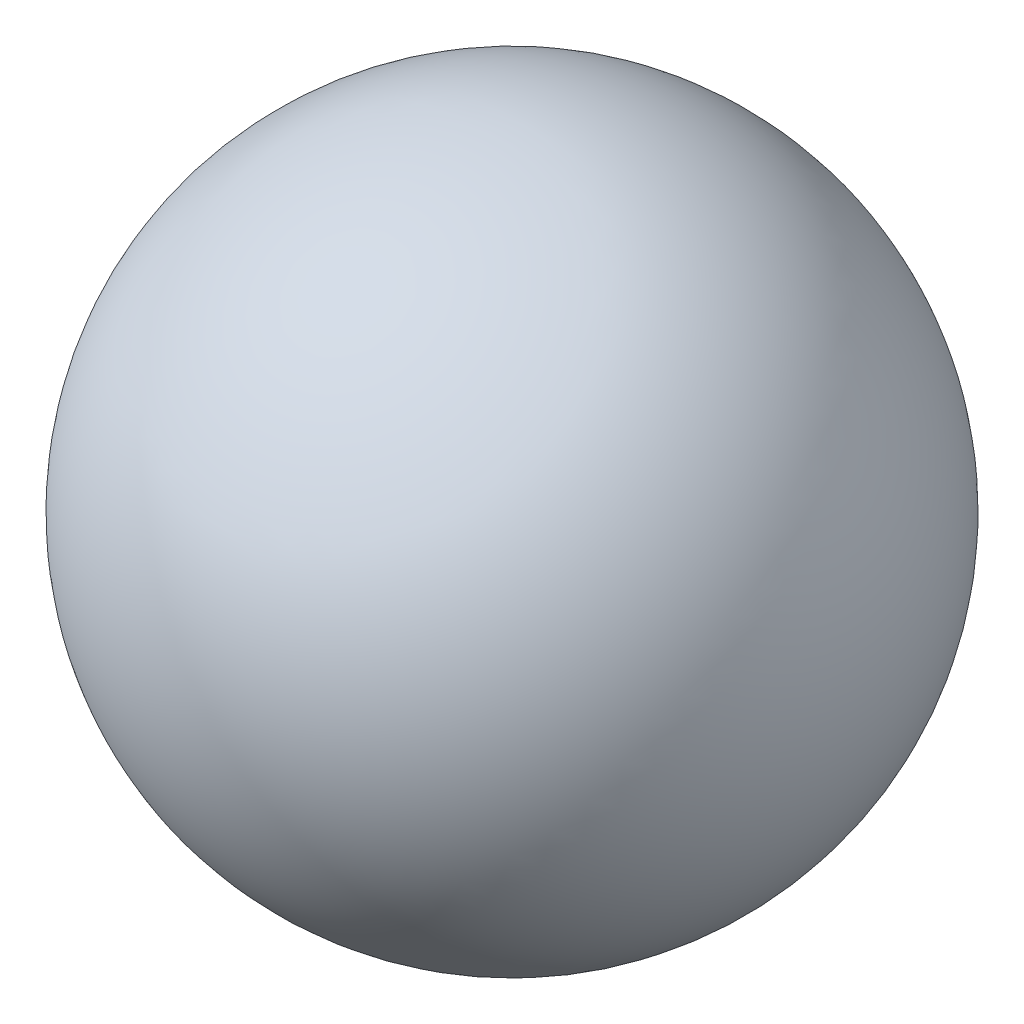
ISO-10303-21;
HEADER;
FILE_DESCRIPTION(('STEP AP214'),'2;1');
FILE_NAME('part.step','',(''),(''),'','','');
FILE_SCHEMA(('AUTOMOTIVE_DESIGN { 1 0 10303 214 1 1 1 1 }'));
ENDSEC;
DATA;
#1=APPLICATION_CONTEXT('core data for automotive mechanical design processes');
#2=APPLICATION_PROTOCOL_DEFINITION('international standard','automotive_design',2000,#1);
#3=PRODUCT_CONTEXT('',#1,'mechanical');
#4=PRODUCT('Part','Part','',(#3));
#5=PRODUCT_RELATED_PRODUCT_CATEGORY('part','',(#4));
#6=PRODUCT_DEFINITION_FORMATION('','',#4);
#7=PRODUCT_DEFINITION_CONTEXT('part definition',#1,'design');
#8=PRODUCT_DEFINITION('design','',#6,#7);
#9=PRODUCT_DEFINITION_SHAPE('','',#8);
#10=(LENGTH_UNIT() NAMED_UNIT(*) SI_UNIT(.MILLI.,.METRE.));
#11=(NAMED_UNIT(*) PLANE_ANGLE_UNIT() SI_UNIT($,.RADIAN.));
#12=(NAMED_UNIT(*) SI_UNIT($,.STERADIAN.) SOLID_ANGLE_UNIT());
#13=UNCERTAINTY_MEASURE_WITH_UNIT(LENGTH_MEASURE(1.E-05),#10,'distance_accuracy_value','');
#14=(GEOMETRIC_REPRESENTATION_CONTEXT(3) GLOBAL_UNCERTAINTY_ASSIGNED_CONTEXT((#13)) GLOBAL_UNIT_ASSIGNED_CONTEXT((#10,
#11,#12)) REPRESENTATION_CONTEXT('',''));
#15=CARTESIAN_POINT('',(0.,0.,0.));
#16=DIRECTION('',(0.,0.,1.));
#17=DIRECTION('',(1.,0.,0.));
#18=AXIS2_PLACEMENT_3D('',#15,#16,#17);
#19=CARTESIAN_POINT('',(-1.11690850882414,-2.,-11.6967950902337));
#20=DIRECTION('',(0.,0.,1.));
#21=DIRECTION('',(1.,0.,0.));
#22=AXIS2_PLACEMENT_3D('',#19,#20,#21);
#23=SPHERICAL_SURFACE('',#22,1.05);
#24=CARTESIAN_POINT('',(-1.11690850882414,-2.,-10.6467950902337));
#25=VERTEX_POINT('',#24);
#26=VERTEX_LOOP('',#25);
#27=FACE_BOUND('',#26,.T.);
#28=ADVANCED_FACE('F12',(#27),#23,.T.);
#29=CLOSED_SHELL('',(#28));
#30=MANIFOLD_SOLID_BREP('B1',#29);
#31=ADVANCED_BREP_SHAPE_REPRESENTATION('',(#18,#30),#14);
#32=SHAPE_DEFINITION_REPRESENTATION(#9,#31);
ENDSEC;
END-ISO-10303-21;
